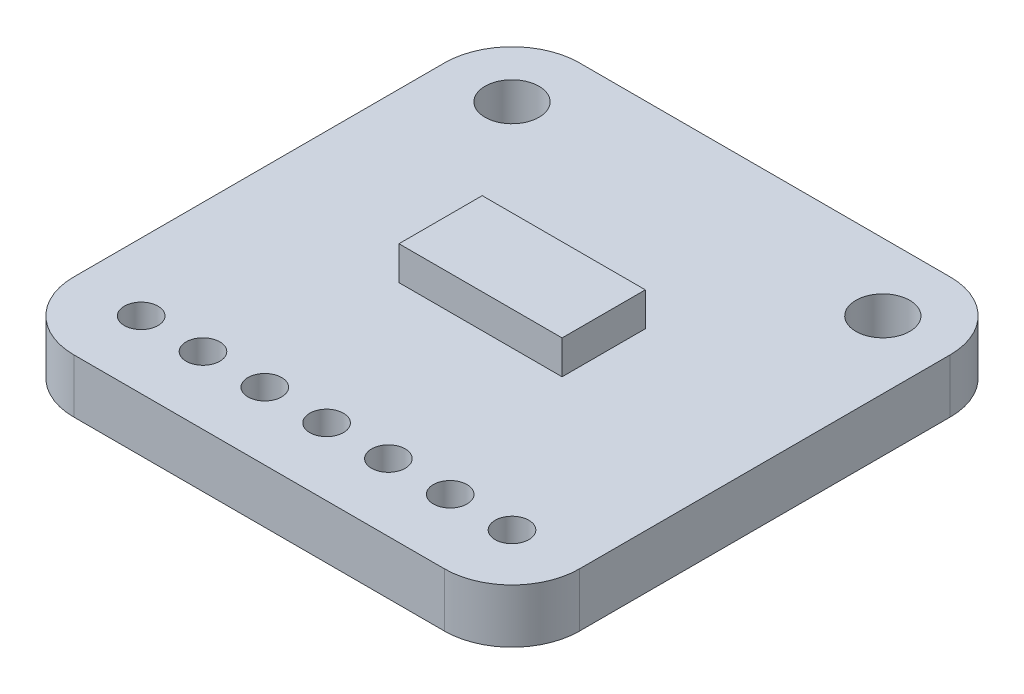
ISO-10303-21;
HEADER;
FILE_DESCRIPTION(('STEP AP214'),'2;1');
FILE_NAME('part.step','',(''),(''),'','','');
FILE_SCHEMA(('AUTOMOTIVE_DESIGN { 1 0 10303 214 1 1 1 1 }'));
ENDSEC;
DATA;
#1=APPLICATION_CONTEXT('core data for automotive mechanical design processes');
#2=APPLICATION_PROTOCOL_DEFINITION('international standard','automotive_design',2000,#1);
#3=PRODUCT_CONTEXT('',#1,'mechanical');
#4=PRODUCT('Part','Part','',(#3));
#5=PRODUCT_RELATED_PRODUCT_CATEGORY('part','',(#4));
#6=PRODUCT_DEFINITION_FORMATION('','',#4);
#7=PRODUCT_DEFINITION_CONTEXT('part definition',#1,'design');
#8=PRODUCT_DEFINITION('design','',#6,#7);
#9=PRODUCT_DEFINITION_SHAPE('','',#8);
#10=(LENGTH_UNIT() NAMED_UNIT(*) SI_UNIT(.MILLI.,.METRE.));
#11=(NAMED_UNIT(*) PLANE_ANGLE_UNIT() SI_UNIT($,.RADIAN.));
#12=(NAMED_UNIT(*) SI_UNIT($,.STERADIAN.) SOLID_ANGLE_UNIT());
#13=UNCERTAINTY_MEASURE_WITH_UNIT(LENGTH_MEASURE(1.E-05),#10,'distance_accuracy_value','');
#14=(GEOMETRIC_REPRESENTATION_CONTEXT(3) GLOBAL_UNCERTAINTY_ASSIGNED_CONTEXT((#13)) GLOBAL_UNIT_ASSIGNED_CONTEXT((#10,
#11,#12)) REPRESENTATION_CONTEXT('',''));
#15=CARTESIAN_POINT('',(0.,0.,0.));
#16=DIRECTION('',(0.,0.,1.));
#17=DIRECTION('',(1.,0.,0.));
#18=AXIS2_PLACEMENT_3D('',#15,#16,#17);
#19=CARTESIAN_POINT('',(2.54,2.032,-16.51));
#20=DIRECTION('',(0.,-1.,0.));
#21=DIRECTION('',(0.,0.,-1.));
#22=AXIS2_PLACEMENT_3D('',#19,#20,#21);
#23=PLANE('',#22);
#24=CARTESIAN_POINT('',(2.54,2.032,-16.51));
#25=DIRECTION('',(0.,1.,0.));
#26=DIRECTION('',(0.,0.,-1.));
#27=AXIS2_PLACEMENT_3D('',#24,#25,#26);
#28=CIRCLE('',#27,2.54);
#29=CARTESIAN_POINT('',(2.54,2.032,-19.05));
#30=VERTEX_POINT('',#29);
#31=CARTESIAN_POINT('',(0.,2.032,-16.51));
#32=VERTEX_POINT('',#31);
#33=EDGE_CURVE('E232',#30,#32,#28,.T.);
#34=ORIENTED_EDGE('',*,*,#33,.T.);
#35=DIRECTION('',(0.,0.,1.));
#36=VECTOR('',#35,1.);
#37=CARTESIAN_POINT('',(0.,2.032,-2.54));
#38=LINE('',#37,#36);
#39=CARTESIAN_POINT('',(0.,2.032,-2.54));
#40=VERTEX_POINT('',#39);
#41=EDGE_CURVE('E236',#32,#40,#38,.T.);
#42=ORIENTED_EDGE('',*,*,#41,.T.);
#43=CARTESIAN_POINT('',(2.54,2.032,-2.54));
#44=DIRECTION('',(0.,1.,0.));
#45=DIRECTION('',(0.,0.,1.));
#46=AXIS2_PLACEMENT_3D('',#43,#44,#45);
#47=CIRCLE('',#46,2.54);
#48=CARTESIAN_POINT('',(2.54,2.032,0.));
#49=VERTEX_POINT('',#48);
#50=EDGE_CURVE('E240',#40,#49,#47,.T.);
#51=ORIENTED_EDGE('',*,*,#50,.T.);
#52=DIRECTION('',(1.,0.,0.));
#53=VECTOR('',#52,1.);
#54=CARTESIAN_POINT('',(16.51,2.032,0.));
#55=LINE('',#54,#53);
#56=CARTESIAN_POINT('',(16.51,2.032,0.));
#57=VERTEX_POINT('',#56);
#58=EDGE_CURVE('E243',#49,#57,#55,.T.);
#59=ORIENTED_EDGE('',*,*,#58,.T.);
#60=CARTESIAN_POINT('',(16.51,2.032,-2.54));
#61=DIRECTION('',(0.,1.,0.));
#62=DIRECTION('',(0.,0.,-1.));
#63=AXIS2_PLACEMENT_3D('',#60,#61,#62);
#64=CIRCLE('',#63,2.54);
#65=CARTESIAN_POINT('',(19.05,2.032,-2.54));
#66=VERTEX_POINT('',#65);
#67=EDGE_CURVE('E246',#57,#66,#64,.T.);
#68=ORIENTED_EDGE('',*,*,#67,.T.);
#69=DIRECTION('',(0.,0.,-1.));
#70=VECTOR('',#69,1.);
#71=CARTESIAN_POINT('',(19.05,2.032,-16.51));
#72=LINE('',#71,#70);
#73=CARTESIAN_POINT('',(19.05,2.032,-16.51));
#74=VERTEX_POINT('',#73);
#75=EDGE_CURVE('E249',#66,#74,#72,.T.);
#76=ORIENTED_EDGE('',*,*,#75,.T.);
#77=CARTESIAN_POINT('',(16.51,2.032,-16.51));
#78=DIRECTION('',(0.,1.,0.));
#79=DIRECTION('',(0.,0.,-1.));
#80=AXIS2_PLACEMENT_3D('',#77,#78,#79);
#81=CIRCLE('',#80,2.54);
#82=CARTESIAN_POINT('',(16.51,2.032,-19.05));
#83=VERTEX_POINT('',#82);
#84=EDGE_CURVE('E252',#74,#83,#81,.T.);
#85=ORIENTED_EDGE('',*,*,#84,.T.);
#86=DIRECTION('',(-1.,0.,0.));
#87=VECTOR('',#86,1.);
#88=CARTESIAN_POINT('',(2.54,2.032,-19.05));
#89=LINE('',#88,#87);
#90=EDGE_CURVE('E255',#83,#30,#89,.T.);
#91=ORIENTED_EDGE('',*,*,#90,.T.);
#92=EDGE_LOOP('',(#34,#42,#51,#59,#68,#76,#85,#91));
#93=FACE_BOUND('',#92,.T.);
#94=CARTESIAN_POINT('',(2.54,2.032,-16.51));
#95=DIRECTION('',(0.,1.,0.));
#96=DIRECTION('',(0.,0.,1.));
#97=AXIS2_PLACEMENT_3D('',#94,#95,#96);
#98=CIRCLE('',#97,1.016);
#99=CARTESIAN_POINT('',(2.54,2.032,-15.494));
#100=VERTEX_POINT('',#99);
#101=EDGE_CURVE('E212',#100,#100,#98,.T.);
#102=ORIENTED_EDGE('',*,*,#101,.F.);
#103=EDGE_LOOP('',(#102));
#104=FACE_BOUND('',#103,.T.);
#105=CARTESIAN_POINT('',(16.51,2.032,-2.54));
#106=DIRECTION('',(0.,1.,0.));
#107=DIRECTION('',(0.,0.,1.));
#108=AXIS2_PLACEMENT_3D('',#105,#106,#107);
#109=CIRCLE('',#108,0.634999999999999);
#110=CARTESIAN_POINT('',(16.51,2.032,-1.905));
#111=VERTEX_POINT('',#110);
#112=EDGE_CURVE('E153',#111,#111,#109,.T.);
#113=ORIENTED_EDGE('',*,*,#112,.F.);
#114=EDGE_LOOP('',(#113));
#115=FACE_BOUND('',#114,.T.);
#116=CARTESIAN_POINT('',(14.1816666666667,2.032,-2.54));
#117=DIRECTION('',(0.,1.,0.));
#118=DIRECTION('',(0.,0.,1.));
#119=AXIS2_PLACEMENT_3D('',#116,#117,#118);
#120=CIRCLE('',#119,0.635000000000001);
#121=CARTESIAN_POINT('',(14.1816666666667,2.032,-1.905));
#122=VERTEX_POINT('',#121);
#123=EDGE_CURVE('E185',#122,#122,#120,.T.);
#124=ORIENTED_EDGE('',*,*,#123,.F.);
#125=EDGE_LOOP('',(#124));
#126=FACE_BOUND('',#125,.T.);
#127=CARTESIAN_POINT('',(11.8533333333333,2.032,-2.54));
#128=DIRECTION('',(0.,1.,0.));
#129=DIRECTION('',(0.,0.,1.));
#130=AXIS2_PLACEMENT_3D('',#127,#128,#129);
#131=CIRCLE('',#130,0.635000000000001);
#132=CARTESIAN_POINT('',(11.8533333333333,2.032,-1.905));
#133=VERTEX_POINT('',#132);
#134=EDGE_CURVE('E177',#133,#133,#131,.T.);
#135=ORIENTED_EDGE('',*,*,#134,.F.);
#136=EDGE_LOOP('',(#135));
#137=FACE_BOUND('',#136,.T.);
#138=CARTESIAN_POINT('',(9.525,2.032,-2.54));
#139=DIRECTION('',(0.,1.,0.));
#140=DIRECTION('',(0.,0.,1.));
#141=AXIS2_PLACEMENT_3D('',#138,#139,#140);
#142=CIRCLE('',#141,0.635000000000001);
#143=CARTESIAN_POINT('',(9.525,2.032,-1.905));
#144=VERTEX_POINT('',#143);
#145=EDGE_CURVE('E169',#144,#144,#142,.T.);
#146=ORIENTED_EDGE('',*,*,#145,.F.);
#147=EDGE_LOOP('',(#146));
#148=FACE_BOUND('',#147,.T.);
#149=CARTESIAN_POINT('',(16.51,2.032,-16.51));
#150=DIRECTION('',(0.,1.,0.));
#151=DIRECTION('',(0.,0.,1.));
#152=AXIS2_PLACEMENT_3D('',#149,#150,#151);
#153=CIRCLE('',#152,1.016);
#154=CARTESIAN_POINT('',(16.51,2.032,-15.494));
#155=VERTEX_POINT('',#154);
#156=EDGE_CURVE('E213',#155,#155,#153,.T.);
#157=ORIENTED_EDGE('',*,*,#156,.F.);
#158=EDGE_LOOP('',(#157));
#159=FACE_BOUND('',#158,.T.);
#160=CARTESIAN_POINT('',(2.54,2.032,-2.54));
#161=DIRECTION('',(0.,1.,0.));
#162=DIRECTION('',(0.,0.,1.));
#163=AXIS2_PLACEMENT_3D('',#160,#161,#162);
#164=CIRCLE('',#163,0.635);
#165=CARTESIAN_POINT('',(2.54,2.032,-1.905));
#166=VERTEX_POINT('',#165);
#167=EDGE_CURVE('E196',#166,#166,#164,.T.);
#168=ORIENTED_EDGE('',*,*,#167,.F.);
#169=EDGE_LOOP('',(#168));
#170=FACE_BOUND('',#169,.T.);
#171=CARTESIAN_POINT('',(4.86833333333333,2.032,-2.54));
#172=DIRECTION('',(0.,1.,0.));
#173=DIRECTION('',(0.,0.,1.));
#174=AXIS2_PLACEMENT_3D('',#171,#172,#173);
#175=CIRCLE('',#174,0.635);
#176=CARTESIAN_POINT('',(4.86833333333333,2.032,-1.905));
#177=VERTEX_POINT('',#176);
#178=EDGE_CURVE('E197',#177,#177,#175,.T.);
#179=ORIENTED_EDGE('',*,*,#178,.F.);
#180=EDGE_LOOP('',(#179));
#181=FACE_BOUND('',#180,.T.);
#182=CARTESIAN_POINT('',(7.19666666666667,2.032,-2.54));
#183=DIRECTION('',(0.,1.,0.));
#184=DIRECTION('',(0.,0.,1.));
#185=AXIS2_PLACEMENT_3D('',#182,#183,#184);
#186=CIRCLE('',#185,0.635000000000001);
#187=CARTESIAN_POINT('',(7.19666666666667,2.032,-1.905));
#188=VERTEX_POINT('',#187);
#189=EDGE_CURVE('E168',#188,#188,#186,.T.);
#190=ORIENTED_EDGE('',*,*,#189,.F.);
#191=EDGE_LOOP('',(#190));
#192=FACE_BOUND('',#191,.T.);
#193=DIRECTION('',(-1.,0.,0.));
#194=VECTOR('',#193,1.);
#195=CARTESIAN_POINT('',(12.4574107433049,2.032,-11.6159363560957));
#196=LINE('',#195,#194);
#197=CARTESIAN_POINT('',(12.4574107433049,2.032,-11.6159363560957));
#198=VERTEX_POINT('',#197);
#199=CARTESIAN_POINT('',(6.31209779429204,2.032,-11.6159363560957));
#200=VERTEX_POINT('',#199);
#201=EDGE_CURVE('E151',#198,#200,#196,.T.);
#202=ORIENTED_EDGE('',*,*,#201,.F.);
#203=DIRECTION('',(0.,0.,-1.));
#204=VECTOR('',#203,1.);
#205=CARTESIAN_POINT('',(12.4574107433049,2.032,-8.47953182195218));
#206=LINE('',#205,#204);
#207=CARTESIAN_POINT('',(12.4574107433049,2.032,-8.47953182195218));
#208=VERTEX_POINT('',#207);
#209=EDGE_CURVE('E148',#208,#198,#206,.T.);
#210=ORIENTED_EDGE('',*,*,#209,.F.);
#211=DIRECTION('',(1.,0.,0.));
#212=VECTOR('',#211,1.);
#213=CARTESIAN_POINT('',(6.31209779429204,2.032,-8.47953182195218));
#214=LINE('',#213,#212);
#215=CARTESIAN_POINT('',(6.31209779429204,2.032,-8.47953182195218));
#216=VERTEX_POINT('',#215);
#217=EDGE_CURVE('E60',#216,#208,#214,.T.);
#218=ORIENTED_EDGE('',*,*,#217,.F.);
#219=DIRECTION('',(0.,0.,1.));
#220=VECTOR('',#219,1.);
#221=CARTESIAN_POINT('',(6.31209779429204,2.032,-11.6159363560957));
#222=LINE('',#221,#220);
#223=EDGE_CURVE('E55',#200,#216,#222,.T.);
#224=ORIENTED_EDGE('',*,*,#223,.F.);
#225=EDGE_LOOP('',(#202,#210,#218,#224));
#226=FACE_BOUND('',#225,.T.);
#227=ADVANCED_FACE('F39',(#93,#104,#115,#126,#137,#148,#159,#170,#181,#192,#226),#23,.F.);
#228=CARTESIAN_POINT('',(2.54,2.032,-16.51));
#229=DIRECTION('',(0.,-1.,0.));
#230=DIRECTION('',(0.,0.,-1.));
#231=AXIS2_PLACEMENT_3D('',#228,#229,#230);
#232=CYLINDRICAL_SURFACE('',#231,2.54);
#233=CARTESIAN_POINT('',(2.54,0.,-16.51));
#234=DIRECTION('',(0.,1.,0.));
#235=DIRECTION('',(0.,0.,-1.));
#236=AXIS2_PLACEMENT_3D('',#233,#234,#235);
#237=CIRCLE('',#236,2.54);
#238=CARTESIAN_POINT('',(2.54,0.,-19.05));
#239=VERTEX_POINT('',#238);
#240=CARTESIAN_POINT('',(0.,0.,-16.51));
#241=VERTEX_POINT('',#240);
#242=EDGE_CURVE('E228',#239,#241,#237,.T.);
#243=ORIENTED_EDGE('',*,*,#242,.T.);
#244=DIRECTION('',(0.,-1.,0.));
#245=VECTOR('',#244,1.);
#246=CARTESIAN_POINT('',(0.,2.032,-16.51));
#247=LINE('',#246,#245);
#248=EDGE_CURVE('E11',#32,#241,#247,.T.);
#249=ORIENTED_EDGE('',*,*,#248,.F.);
#250=ORIENTED_EDGE('',*,*,#33,.F.);
#251=DIRECTION('',(0.,-1.,0.));
#252=VECTOR('',#251,1.);
#253=CARTESIAN_POINT('',(2.54,2.032,-19.05));
#254=LINE('',#253,#252);
#255=EDGE_CURVE('E258',#30,#239,#254,.T.);
#256=ORIENTED_EDGE('',*,*,#255,.T.);
#257=EDGE_LOOP('',(#243,#249,#250,#256));
#258=FACE_BOUND('',#257,.T.);
#259=ADVANCED_FACE('F41',(#258),#232,.T.);
#260=CARTESIAN_POINT('',(0.,2.032,-2.54));
#261=DIRECTION('',(1.,0.,0.));
#262=DIRECTION('',(0.,0.,-1.));
#263=AXIS2_PLACEMENT_3D('',#260,#261,#262);
#264=PLANE('',#263);
#265=DIRECTION('',(0.,0.,1.));
#266=VECTOR('',#265,1.);
#267=CARTESIAN_POINT('',(0.,0.,-2.54));
#268=LINE('',#267,#266);
#269=CARTESIAN_POINT('',(0.,0.,-2.54));
#270=VERTEX_POINT('',#269);
#271=EDGE_CURVE('E262',#241,#270,#268,.T.);
#272=ORIENTED_EDGE('',*,*,#271,.T.);
#273=DIRECTION('',(0.,-1.,0.));
#274=VECTOR('',#273,1.);
#275=CARTESIAN_POINT('',(0.,2.032,-2.54));
#276=LINE('',#275,#274);
#277=EDGE_CURVE('E48',#40,#270,#276,.T.);
#278=ORIENTED_EDGE('',*,*,#277,.F.);
#279=ORIENTED_EDGE('',*,*,#41,.F.);
#280=ORIENTED_EDGE('',*,*,#248,.T.);
#281=EDGE_LOOP('',(#272,#278,#279,#280));
#282=FACE_BOUND('',#281,.T.);
#283=ADVANCED_FACE('F333',(#282),#264,.F.);
#284=CARTESIAN_POINT('',(2.54,2.032,-2.54));
#285=DIRECTION('',(0.,-1.,0.));
#286=DIRECTION('',(0.,0.,-1.));
#287=AXIS2_PLACEMENT_3D('',#284,#285,#286);
#288=CYLINDRICAL_SURFACE('',#287,2.54);
#289=CARTESIAN_POINT('',(2.54,0.,-2.54));
#290=DIRECTION('',(0.,1.,0.));
#291=DIRECTION('',(0.,0.,1.));
#292=AXIS2_PLACEMENT_3D('',#289,#290,#291);
#293=CIRCLE('',#292,2.54);
#294=CARTESIAN_POINT('',(2.54,0.,0.));
#295=VERTEX_POINT('',#294);
#296=EDGE_CURVE('E265',#270,#295,#293,.T.);
#297=ORIENTED_EDGE('',*,*,#296,.T.);
#298=DIRECTION('',(0.,-1.,0.));
#299=VECTOR('',#298,1.);
#300=CARTESIAN_POINT('',(2.54,2.032,0.));
#301=LINE('',#300,#299);
#302=EDGE_CURVE('E301',#49,#295,#301,.T.);
#303=ORIENTED_EDGE('',*,*,#302,.F.);
#304=ORIENTED_EDGE('',*,*,#50,.F.);
#305=ORIENTED_EDGE('',*,*,#277,.T.);
#306=EDGE_LOOP('',(#297,#303,#304,#305));
#307=FACE_BOUND('',#306,.T.);
#308=ADVANCED_FACE('F310',(#307),#288,.T.);
#309=CARTESIAN_POINT('',(16.51,2.032,0.));
#310=DIRECTION('',(0.,0.,-1.));
#311=DIRECTION('',(-1.,0.,0.));
#312=AXIS2_PLACEMENT_3D('',#309,#310,#311);
#313=PLANE('',#312);
#314=DIRECTION('',(1.,0.,0.));
#315=VECTOR('',#314,1.);
#316=CARTESIAN_POINT('',(16.51,0.,0.));
#317=LINE('',#316,#315);
#318=CARTESIAN_POINT('',(16.51,0.,0.));
#319=VERTEX_POINT('',#318);
#320=EDGE_CURVE('E268',#295,#319,#317,.T.);
#321=ORIENTED_EDGE('',*,*,#320,.T.);
#322=DIRECTION('',(0.,-1.,0.));
#323=VECTOR('',#322,1.);
#324=CARTESIAN_POINT('',(16.51,2.032,0.));
#325=LINE('',#324,#323);
#326=EDGE_CURVE('E297',#57,#319,#325,.T.);
#327=ORIENTED_EDGE('',*,*,#326,.F.);
#328=ORIENTED_EDGE('',*,*,#58,.F.);
#329=ORIENTED_EDGE('',*,*,#302,.T.);
#330=EDGE_LOOP('',(#321,#327,#328,#329));
#331=FACE_BOUND('',#330,.T.);
#332=ADVANCED_FACE('F321',(#331),#313,.F.);
#333=CARTESIAN_POINT('',(16.51,2.032,-2.54));
#334=DIRECTION('',(0.,-1.,0.));
#335=DIRECTION('',(0.,0.,-1.));
#336=AXIS2_PLACEMENT_3D('',#333,#334,#335);
#337=CYLINDRICAL_SURFACE('',#336,2.54);
#338=CARTESIAN_POINT('',(16.51,0.,-2.54));
#339=DIRECTION('',(0.,1.,0.));
#340=DIRECTION('',(0.,0.,-1.));
#341=AXIS2_PLACEMENT_3D('',#338,#339,#340);
#342=CIRCLE('',#341,2.54);
#343=CARTESIAN_POINT('',(19.05,0.,-2.54));
#344=VERTEX_POINT('',#343);
#345=EDGE_CURVE('E271',#319,#344,#342,.T.);
#346=ORIENTED_EDGE('',*,*,#345,.T.);
#347=DIRECTION('',(0.,-1.,0.));
#348=VECTOR('',#347,1.);
#349=CARTESIAN_POINT('',(19.05,2.032,-2.54));
#350=LINE('',#349,#348);
#351=EDGE_CURVE('E293',#66,#344,#350,.T.);
#352=ORIENTED_EDGE('',*,*,#351,.F.);
#353=ORIENTED_EDGE('',*,*,#67,.F.);
#354=ORIENTED_EDGE('',*,*,#326,.T.);
#355=EDGE_LOOP('',(#346,#352,#353,#354));
#356=FACE_BOUND('',#355,.T.);
#357=ADVANCED_FACE('F325',(#356),#337,.T.);
#358=CARTESIAN_POINT('',(19.05,2.032,-16.51));
#359=DIRECTION('',(-1.,0.,0.));
#360=DIRECTION('',(0.,0.,1.));
#361=AXIS2_PLACEMENT_3D('',#358,#359,#360);
#362=PLANE('',#361);
#363=DIRECTION('',(0.,0.,-1.));
#364=VECTOR('',#363,1.);
#365=CARTESIAN_POINT('',(19.05,0.,-16.51));
#366=LINE('',#365,#364);
#367=CARTESIAN_POINT('',(19.05,0.,-16.51));
#368=VERTEX_POINT('',#367);
#369=EDGE_CURVE('E274',#344,#368,#366,.T.);
#370=ORIENTED_EDGE('',*,*,#369,.T.);
#371=DIRECTION('',(0.,-1.,0.));
#372=VECTOR('',#371,1.);
#373=CARTESIAN_POINT('',(19.05,2.032,-16.51));
#374=LINE('',#373,#372);
#375=EDGE_CURVE('E289',#74,#368,#374,.T.);
#376=ORIENTED_EDGE('',*,*,#375,.F.);
#377=ORIENTED_EDGE('',*,*,#75,.F.);
#378=ORIENTED_EDGE('',*,*,#351,.T.);
#379=EDGE_LOOP('',(#370,#376,#377,#378));
#380=FACE_BOUND('',#379,.T.);
#381=ADVANCED_FACE('F346',(#380),#362,.F.);
#382=CARTESIAN_POINT('',(16.51,2.032,-16.51));
#383=DIRECTION('',(0.,-1.,0.));
#384=DIRECTION('',(0.,0.,-1.));
#385=AXIS2_PLACEMENT_3D('',#382,#383,#384);
#386=CYLINDRICAL_SURFACE('',#385,2.54);
#387=CARTESIAN_POINT('',(16.51,0.,-16.51));
#388=DIRECTION('',(0.,1.,0.));
#389=DIRECTION('',(0.,0.,-1.));
#390=AXIS2_PLACEMENT_3D('',#387,#388,#389);
#391=CIRCLE('',#390,2.54);
#392=CARTESIAN_POINT('',(16.51,0.,-19.05));
#393=VERTEX_POINT('',#392);
#394=EDGE_CURVE('E277',#368,#393,#391,.T.);
#395=ORIENTED_EDGE('',*,*,#394,.T.);
#396=DIRECTION('',(0.,-1.,0.));
#397=VECTOR('',#396,1.);
#398=CARTESIAN_POINT('',(16.51,2.032,-19.05));
#399=LINE('',#398,#397);
#400=EDGE_CURVE('E285',#83,#393,#399,.T.);
#401=ORIENTED_EDGE('',*,*,#400,.F.);
#402=ORIENTED_EDGE('',*,*,#84,.F.);
#403=ORIENTED_EDGE('',*,*,#375,.T.);
#404=EDGE_LOOP('',(#395,#401,#402,#403));
#405=FACE_BOUND('',#404,.T.);
#406=ADVANCED_FACE('F344',(#405),#386,.T.);
#407=CARTESIAN_POINT('',(2.54,2.032,-19.05));
#408=DIRECTION('',(0.,0.,1.));
#409=DIRECTION('',(1.,0.,0.));
#410=AXIS2_PLACEMENT_3D('',#407,#408,#409);
#411=PLANE('',#410);
#412=DIRECTION('',(-1.,0.,0.));
#413=VECTOR('',#412,1.);
#414=CARTESIAN_POINT('',(2.54,0.,-19.05));
#415=LINE('',#414,#413);
#416=EDGE_CURVE('E237',#393,#239,#415,.T.);
#417=ORIENTED_EDGE('',*,*,#416,.T.);
#418=ORIENTED_EDGE('',*,*,#255,.F.);
#419=ORIENTED_EDGE('',*,*,#90,.F.);
#420=ORIENTED_EDGE('',*,*,#400,.T.);
#421=EDGE_LOOP('',(#417,#418,#419,#420));
#422=FACE_BOUND('',#421,.T.);
#423=ADVANCED_FACE('F339',(#422),#411,.F.);
#424=CARTESIAN_POINT('',(2.54,0.,-16.51));
#425=DIRECTION('',(0.,-1.,0.));
#426=DIRECTION('',(0.,0.,-1.));
#427=AXIS2_PLACEMENT_3D('',#424,#425,#426);
#428=PLANE('',#427);
#429=CARTESIAN_POINT('',(7.19666666666667,0.,-2.54));
#430=DIRECTION('',(0.,1.,0.));
#431=DIRECTION('',(0.,0.,1.));
#432=AXIS2_PLACEMENT_3D('',#429,#430,#431);
#433=CIRCLE('',#432,0.635000000000001);
#434=CARTESIAN_POINT('',(7.19666666666667,0.,-1.905));
#435=VERTEX_POINT('',#434);
#436=EDGE_CURVE('E201',#435,#435,#433,.T.);
#437=ORIENTED_EDGE('',*,*,#436,.T.);
#438=EDGE_LOOP('',(#437));
#439=FACE_BOUND('',#438,.T.);
#440=CARTESIAN_POINT('',(4.86833333333333,0.,-2.54));
#441=DIRECTION('',(0.,1.,0.));
#442=DIRECTION('',(0.,0.,1.));
#443=AXIS2_PLACEMENT_3D('',#440,#441,#442);
#444=CIRCLE('',#443,0.635);
#445=CARTESIAN_POINT('',(4.86833333333333,0.,-1.905));
#446=VERTEX_POINT('',#445);
#447=EDGE_CURVE('E192',#446,#446,#444,.T.);
#448=ORIENTED_EDGE('',*,*,#447,.T.);
#449=EDGE_LOOP('',(#448));
#450=FACE_BOUND('',#449,.T.);
#451=CARTESIAN_POINT('',(2.54,0.,-2.54));
#452=DIRECTION('',(0.,1.,0.));
#453=DIRECTION('',(0.,0.,1.));
#454=AXIS2_PLACEMENT_3D('',#451,#452,#453);
#455=CIRCLE('',#454,0.635);
#456=CARTESIAN_POINT('',(2.54,0.,-1.905));
#457=VERTEX_POINT('',#456);
#458=EDGE_CURVE('E217',#457,#457,#455,.T.);
#459=ORIENTED_EDGE('',*,*,#458,.T.);
#460=EDGE_LOOP('',(#459));
#461=FACE_BOUND('',#460,.T.);
#462=CARTESIAN_POINT('',(16.51,0.,-16.51));
#463=DIRECTION('',(0.,1.,0.));
#464=DIRECTION('',(0.,0.,1.));
#465=AXIS2_PLACEMENT_3D('',#462,#463,#464);
#466=CIRCLE('',#465,1.016);
#467=CARTESIAN_POINT('',(16.51,0.,-15.494));
#468=VERTEX_POINT('',#467);
#469=EDGE_CURVE('E208',#468,#468,#466,.T.);
#470=ORIENTED_EDGE('',*,*,#469,.T.);
#471=EDGE_LOOP('',(#470));
#472=FACE_BOUND('',#471,.T.);
#473=CARTESIAN_POINT('',(9.525,0.,-2.54));
#474=DIRECTION('',(0.,1.,0.));
#475=DIRECTION('',(0.,0.,1.));
#476=AXIS2_PLACEMENT_3D('',#473,#474,#475);
#477=CIRCLE('',#476,0.635000000000001);
#478=CARTESIAN_POINT('',(9.525,0.,-1.905));
#479=VERTEX_POINT('',#478);
#480=EDGE_CURVE('E164',#479,#479,#477,.T.);
#481=ORIENTED_EDGE('',*,*,#480,.T.);
#482=EDGE_LOOP('',(#481));
#483=FACE_BOUND('',#482,.T.);
#484=CARTESIAN_POINT('',(11.8533333333333,0.,-2.54));
#485=DIRECTION('',(0.,1.,0.));
#486=DIRECTION('',(0.,0.,1.));
#487=AXIS2_PLACEMENT_3D('',#484,#485,#486);
#488=CIRCLE('',#487,0.635000000000001);
#489=CARTESIAN_POINT('',(11.8533333333333,0.,-1.905));
#490=VERTEX_POINT('',#489);
#491=EDGE_CURVE('E173',#490,#490,#488,.T.);
#492=ORIENTED_EDGE('',*,*,#491,.T.);
#493=EDGE_LOOP('',(#492));
#494=FACE_BOUND('',#493,.T.);
#495=CARTESIAN_POINT('',(14.1816666666667,0.,-2.54));
#496=DIRECTION('',(0.,1.,0.));
#497=DIRECTION('',(0.,0.,1.));
#498=AXIS2_PLACEMENT_3D('',#495,#496,#497);
#499=CIRCLE('',#498,0.635000000000001);
#500=CARTESIAN_POINT('',(14.1816666666667,0.,-1.905));
#501=VERTEX_POINT('',#500);
#502=EDGE_CURVE('E181',#501,#501,#499,.T.);
#503=ORIENTED_EDGE('',*,*,#502,.T.);
#504=EDGE_LOOP('',(#503));
#505=FACE_BOUND('',#504,.T.);
#506=CARTESIAN_POINT('',(16.51,0.,-2.54));
#507=DIRECTION('',(0.,1.,0.));
#508=DIRECTION('',(0.,0.,1.));
#509=AXIS2_PLACEMENT_3D('',#506,#507,#508);
#510=CIRCLE('',#509,0.634999999999999);
#511=CARTESIAN_POINT('',(16.51,0.,-1.905));
#512=VERTEX_POINT('',#511);
#513=EDGE_CURVE('E158',#512,#512,#510,.T.);
#514=ORIENTED_EDGE('',*,*,#513,.T.);
#515=EDGE_LOOP('',(#514));
#516=FACE_BOUND('',#515,.T.);
#517=CARTESIAN_POINT('',(2.54,0.,-16.51));
#518=DIRECTION('',(0.,1.,0.));
#519=DIRECTION('',(0.,0.,1.));
#520=AXIS2_PLACEMENT_3D('',#517,#518,#519);
#521=CIRCLE('',#520,1.016);
#522=CARTESIAN_POINT('',(2.54,0.,-15.494));
#523=VERTEX_POINT('',#522);
#524=EDGE_CURVE('E224',#523,#523,#521,.T.);
#525=ORIENTED_EDGE('',*,*,#524,.T.);
#526=EDGE_LOOP('',(#525));
#527=FACE_BOUND('',#526,.T.);
#528=ORIENTED_EDGE('',*,*,#242,.F.);
#529=ORIENTED_EDGE('',*,*,#416,.F.);
#530=ORIENTED_EDGE('',*,*,#394,.F.);
#531=ORIENTED_EDGE('',*,*,#369,.F.);
#532=ORIENTED_EDGE('',*,*,#345,.F.);
#533=ORIENTED_EDGE('',*,*,#320,.F.);
#534=ORIENTED_EDGE('',*,*,#296,.F.);
#535=ORIENTED_EDGE('',*,*,#271,.F.);
#536=EDGE_LOOP('',(#528,#529,#530,#531,#532,#533,#534,#535));
#537=FACE_BOUND('',#536,.T.);
#538=ADVANCED_FACE('F316',(#439,#450,#461,#472,#483,#494,#505,#516,#527,#537),#428,.T.);
#539=CARTESIAN_POINT('',(2.54,0.,-16.51));
#540=DIRECTION('',(0.,1.,0.));
#541=DIRECTION('',(0.,0.,1.));
#542=AXIS2_PLACEMENT_3D('',#539,#540,#541);
#543=CYLINDRICAL_SURFACE('',#542,1.016);
#544=ORIENTED_EDGE('',*,*,#524,.F.);
#545=EDGE_LOOP('',(#544));
#546=FACE_BOUND('',#545,.T.);
#547=ORIENTED_EDGE('',*,*,#101,.T.);
#548=EDGE_LOOP('',(#547));
#549=FACE_BOUND('',#548,.T.);
#550=ADVANCED_FACE('F364',(#546,#549),#543,.F.);
#551=CARTESIAN_POINT('',(16.51,0.,-2.54));
#552=DIRECTION('',(0.,1.,0.));
#553=DIRECTION('',(0.,0.,1.));
#554=AXIS2_PLACEMENT_3D('',#551,#552,#553);
#555=CYLINDRICAL_SURFACE('',#554,0.634999999999999);
#556=ORIENTED_EDGE('',*,*,#513,.F.);
#557=EDGE_LOOP('',(#556));
#558=FACE_BOUND('',#557,.T.);
#559=ORIENTED_EDGE('',*,*,#112,.T.);
#560=EDGE_LOOP('',(#559));
#561=FACE_BOUND('',#560,.T.);
#562=ADVANCED_FACE('F384',(#558,#561),#555,.F.);
#563=CARTESIAN_POINT('',(14.1816666666667,0.,-2.54));
#564=DIRECTION('',(0.,1.,0.));
#565=DIRECTION('',(0.,0.,1.));
#566=AXIS2_PLACEMENT_3D('',#563,#564,#565);
#567=CYLINDRICAL_SURFACE('',#566,0.635000000000001);
#568=ORIENTED_EDGE('',*,*,#502,.F.);
#569=EDGE_LOOP('',(#568));
#570=FACE_BOUND('',#569,.T.);
#571=ORIENTED_EDGE('',*,*,#123,.T.);
#572=EDGE_LOOP('',(#571));
#573=FACE_BOUND('',#572,.T.);
#574=ADVANCED_FACE('F391',(#570,#573),#567,.F.);
#575=CARTESIAN_POINT('',(11.8533333333333,0.,-2.54));
#576=DIRECTION('',(0.,1.,0.));
#577=DIRECTION('',(0.,0.,1.));
#578=AXIS2_PLACEMENT_3D('',#575,#576,#577);
#579=CYLINDRICAL_SURFACE('',#578,0.635000000000001);
#580=ORIENTED_EDGE('',*,*,#491,.F.);
#581=EDGE_LOOP('',(#580));
#582=FACE_BOUND('',#581,.T.);
#583=ORIENTED_EDGE('',*,*,#134,.T.);
#584=EDGE_LOOP('',(#583));
#585=FACE_BOUND('',#584,.T.);
#586=ADVANCED_FACE('F399',(#582,#585),#579,.F.);
#587=CARTESIAN_POINT('',(9.525,0.,-2.54));
#588=DIRECTION('',(0.,1.,0.));
#589=DIRECTION('',(0.,0.,1.));
#590=AXIS2_PLACEMENT_3D('',#587,#588,#589);
#591=CYLINDRICAL_SURFACE('',#590,0.635000000000001);
#592=ORIENTED_EDGE('',*,*,#480,.F.);
#593=EDGE_LOOP('',(#592));
#594=FACE_BOUND('',#593,.T.);
#595=ORIENTED_EDGE('',*,*,#145,.T.);
#596=EDGE_LOOP('',(#595));
#597=FACE_BOUND('',#596,.T.);
#598=ADVANCED_FACE('F407',(#594,#597),#591,.F.);
#599=CARTESIAN_POINT('',(16.51,0.,-16.51));
#600=DIRECTION('',(0.,1.,0.));
#601=DIRECTION('',(0.,0.,1.));
#602=AXIS2_PLACEMENT_3D('',#599,#600,#601);
#603=CYLINDRICAL_SURFACE('',#602,1.016);
#604=ORIENTED_EDGE('',*,*,#469,.F.);
#605=EDGE_LOOP('',(#604));
#606=FACE_BOUND('',#605,.T.);
#607=ORIENTED_EDGE('',*,*,#156,.T.);
#608=EDGE_LOOP('',(#607));
#609=FACE_BOUND('',#608,.T.);
#610=ADVANCED_FACE('F415',(#606,#609),#603,.F.);
#611=CARTESIAN_POINT('',(2.54,0.,-2.54));
#612=DIRECTION('',(0.,1.,0.));
#613=DIRECTION('',(0.,0.,1.));
#614=AXIS2_PLACEMENT_3D('',#611,#612,#613);
#615=CYLINDRICAL_SURFACE('',#614,0.635);
#616=ORIENTED_EDGE('',*,*,#458,.F.);
#617=EDGE_LOOP('',(#616));
#618=FACE_BOUND('',#617,.T.);
#619=ORIENTED_EDGE('',*,*,#167,.T.);
#620=EDGE_LOOP('',(#619));
#621=FACE_BOUND('',#620,.T.);
#622=ADVANCED_FACE('F423',(#618,#621),#615,.F.);
#623=CARTESIAN_POINT('',(4.86833333333333,0.,-2.54));
#624=DIRECTION('',(0.,1.,0.));
#625=DIRECTION('',(0.,0.,1.));
#626=AXIS2_PLACEMENT_3D('',#623,#624,#625);
#627=CYLINDRICAL_SURFACE('',#626,0.635);
#628=ORIENTED_EDGE('',*,*,#447,.F.);
#629=EDGE_LOOP('',(#628));
#630=FACE_BOUND('',#629,.T.);
#631=ORIENTED_EDGE('',*,*,#178,.T.);
#632=EDGE_LOOP('',(#631));
#633=FACE_BOUND('',#632,.T.);
#634=ADVANCED_FACE('F431',(#630,#633),#627,.F.);
#635=CARTESIAN_POINT('',(7.19666666666667,0.,-2.54));
#636=DIRECTION('',(0.,1.,0.));
#637=DIRECTION('',(0.,0.,1.));
#638=AXIS2_PLACEMENT_3D('',#635,#636,#637);
#639=CYLINDRICAL_SURFACE('',#638,0.635000000000001);
#640=ORIENTED_EDGE('',*,*,#436,.F.);
#641=EDGE_LOOP('',(#640));
#642=FACE_BOUND('',#641,.T.);
#643=ORIENTED_EDGE('',*,*,#189,.T.);
#644=EDGE_LOOP('',(#643));
#645=FACE_BOUND('',#644,.T.);
#646=ADVANCED_FACE('F438',(#642,#645),#639,.F.);
#647=CARTESIAN_POINT('',(12.4574107433049,3.302,-11.6159363560957));
#648=DIRECTION('',(0.,0.,1.));
#649=DIRECTION('',(1.,0.,0.));
#650=AXIS2_PLACEMENT_3D('',#647,#648,#649);
#651=PLANE('',#650);
#652=ORIENTED_EDGE('',*,*,#201,.T.);
#653=DIRECTION('',(0.,-1.,0.));
#654=VECTOR('',#653,1.);
#655=CARTESIAN_POINT('',(6.31209779429204,3.302,-11.6159363560957));
#656=LINE('',#655,#654);
#657=CARTESIAN_POINT('',(6.31209779429204,3.302,-11.6159363560957));
#658=VERTEX_POINT('',#657);
#659=EDGE_CURVE('E130',#658,#200,#656,.T.);
#660=ORIENTED_EDGE('',*,*,#659,.F.);
#661=DIRECTION('',(-1.,0.,0.));
#662=VECTOR('',#661,1.);
#663=CARTESIAN_POINT('',(12.4574107433049,3.302,-11.6159363560957));
#664=LINE('',#663,#662);
#665=CARTESIAN_POINT('',(12.4574107433049,3.302,-11.6159363560957));
#666=VERTEX_POINT('',#665);
#667=EDGE_CURVE('E138',#666,#658,#664,.T.);
#668=ORIENTED_EDGE('',*,*,#667,.F.);
#669=DIRECTION('',(0.,-1.,0.));
#670=VECTOR('',#669,1.);
#671=CARTESIAN_POINT('',(12.4574107433049,3.302,-11.6159363560957));
#672=LINE('',#671,#670);
#673=EDGE_CURVE('E497',#666,#198,#672,.T.);
#674=ORIENTED_EDGE('',*,*,#673,.T.);
#675=EDGE_LOOP('',(#652,#660,#668,#674));
#676=FACE_BOUND('',#675,.T.);
#677=ADVANCED_FACE('F150',(#676),#651,.F.);
#678=CARTESIAN_POINT('',(6.31209779429204,3.302,-11.6159363560957));
#679=DIRECTION('',(1.,0.,0.));
#680=DIRECTION('',(0.,0.,-1.));
#681=AXIS2_PLACEMENT_3D('',#678,#679,#680);
#682=PLANE('',#681);
#683=ORIENTED_EDGE('',*,*,#223,.T.);
#684=DIRECTION('',(0.,-1.,0.));
#685=VECTOR('',#684,1.);
#686=CARTESIAN_POINT('',(6.31209779429204,3.302,-8.47953182195218));
#687=LINE('',#686,#685);
#688=CARTESIAN_POINT('',(6.31209779429204,3.302,-8.47953182195218));
#689=VERTEX_POINT('',#688);
#690=EDGE_CURVE('E133',#689,#216,#687,.T.);
#691=ORIENTED_EDGE('',*,*,#690,.F.);
#692=DIRECTION('',(0.,0.,1.));
#693=VECTOR('',#692,1.);
#694=CARTESIAN_POINT('',(6.31209779429204,3.302,-11.6159363560957));
#695=LINE('',#694,#693);
#696=EDGE_CURVE('E126',#658,#689,#695,.T.);
#697=ORIENTED_EDGE('',*,*,#696,.F.);
#698=ORIENTED_EDGE('',*,*,#659,.T.);
#699=EDGE_LOOP('',(#683,#691,#697,#698));
#700=FACE_BOUND('',#699,.T.);
#701=ADVANCED_FACE('F128',(#700),#682,.F.);
#702=CARTESIAN_POINT('',(6.31209779429204,3.302,-8.47953182195218));
#703=DIRECTION('',(0.,0.,-1.));
#704=DIRECTION('',(-1.,0.,0.));
#705=AXIS2_PLACEMENT_3D('',#702,#703,#704);
#706=PLANE('',#705);
#707=ORIENTED_EDGE('',*,*,#217,.T.);
#708=DIRECTION('',(0.,-1.,0.));
#709=VECTOR('',#708,1.);
#710=CARTESIAN_POINT('',(12.4574107433049,3.302,-8.47953182195218));
#711=LINE('',#710,#709);
#712=CARTESIAN_POINT('',(12.4574107433049,3.302,-8.47953182195218));
#713=VERTEX_POINT('',#712);
#714=EDGE_CURVE('E160',#713,#208,#711,.T.);
#715=ORIENTED_EDGE('',*,*,#714,.F.);
#716=DIRECTION('',(1.,0.,0.));
#717=VECTOR('',#716,1.);
#718=CARTESIAN_POINT('',(6.31209779429204,3.302,-8.47953182195218));
#719=LINE('',#718,#717);
#720=EDGE_CURVE('E137',#689,#713,#719,.T.);
#721=ORIENTED_EDGE('',*,*,#720,.F.);
#722=ORIENTED_EDGE('',*,*,#690,.T.);
#723=EDGE_LOOP('',(#707,#715,#721,#722));
#724=FACE_BOUND('',#723,.T.);
#725=ADVANCED_FACE('F461',(#724),#706,.F.);
#726=CARTESIAN_POINT('',(12.4574107433049,3.302,-8.47953182195218));
#727=DIRECTION('',(-1.,0.,0.));
#728=DIRECTION('',(0.,0.,1.));
#729=AXIS2_PLACEMENT_3D('',#726,#727,#728);
#730=PLANE('',#729);
#731=ORIENTED_EDGE('',*,*,#209,.T.);
#732=ORIENTED_EDGE('',*,*,#673,.F.);
#733=DIRECTION('',(0.,0.,-1.));
#734=VECTOR('',#733,1.);
#735=CARTESIAN_POINT('',(12.4574107433049,3.302,-8.47953182195218));
#736=LINE('',#735,#734);
#737=EDGE_CURVE('E143',#713,#666,#736,.T.);
#738=ORIENTED_EDGE('',*,*,#737,.F.);
#739=ORIENTED_EDGE('',*,*,#714,.T.);
#740=EDGE_LOOP('',(#731,#732,#738,#739));
#741=FACE_BOUND('',#740,.T.);
#742=ADVANCED_FACE('F468',(#741),#730,.F.);
#743=CARTESIAN_POINT('',(0.,3.302,0.));
#744=DIRECTION('',(0.,1.,0.));
#745=DIRECTION('',(0.,0.,1.));
#746=AXIS2_PLACEMENT_3D('',#743,#744,#745);
#747=PLANE('',#746);
#748=ORIENTED_EDGE('',*,*,#667,.T.);
#749=ORIENTED_EDGE('',*,*,#696,.T.);
#750=ORIENTED_EDGE('',*,*,#720,.T.);
#751=ORIENTED_EDGE('',*,*,#737,.T.);
#752=EDGE_LOOP('',(#748,#749,#750,#751));
#753=FACE_BOUND('',#752,.T.);
#754=ADVANCED_FACE('F141',(#753),#747,.T.);
#755=CLOSED_SHELL('',(#227,#259,#283,#308,#332,#357,#381,#406,#423,#538,#550,#562,#574,#586,
#598,#610,#622,#634,#646,#677,#701,#725,#742,#754));
#756=MANIFOLD_SOLID_BREP('B2',#755);
#757=ADVANCED_BREP_SHAPE_REPRESENTATION('',(#18,#756),#14);
#758=SHAPE_DEFINITION_REPRESENTATION(#9,#757);
ENDSEC;
END-ISO-10303-21;
